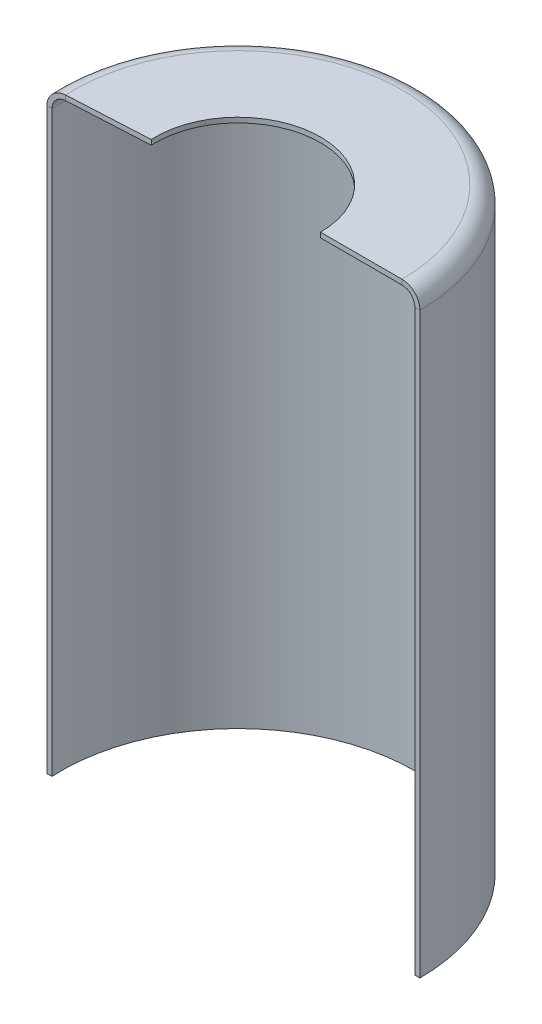
ISO-10303-21;
HEADER;
FILE_DESCRIPTION(('STEP AP214'),'2;1');
FILE_NAME('part.step','',(''),(''),'','','');
FILE_SCHEMA(('AUTOMOTIVE_DESIGN { 1 0 10303 214 1 1 1 1 }'));
ENDSEC;
DATA;
#1=APPLICATION_CONTEXT('core data for automotive mechanical design processes');
#2=APPLICATION_PROTOCOL_DEFINITION('international standard','automotive_design',2000,#1);
#3=PRODUCT_CONTEXT('',#1,'mechanical');
#4=PRODUCT('Part','Part','',(#3));
#5=PRODUCT_RELATED_PRODUCT_CATEGORY('part','',(#4));
#6=PRODUCT_DEFINITION_FORMATION('','',#4);
#7=PRODUCT_DEFINITION_CONTEXT('part definition',#1,'design');
#8=PRODUCT_DEFINITION('design','',#6,#7);
#9=PRODUCT_DEFINITION_SHAPE('','',#8);
#10=(LENGTH_UNIT() NAMED_UNIT(*) SI_UNIT(.MILLI.,.METRE.));
#11=(NAMED_UNIT(*) PLANE_ANGLE_UNIT() SI_UNIT($,.RADIAN.));
#12=(NAMED_UNIT(*) SI_UNIT($,.STERADIAN.) SOLID_ANGLE_UNIT());
#13=UNCERTAINTY_MEASURE_WITH_UNIT(LENGTH_MEASURE(1.E-05),#10,'distance_accuracy_value','');
#14=(GEOMETRIC_REPRESENTATION_CONTEXT(3) GLOBAL_UNCERTAINTY_ASSIGNED_CONTEXT((#13)) GLOBAL_UNIT_ASSIGNED_CONTEXT((#10,
#11,#12)) REPRESENTATION_CONTEXT('',''));
#15=CARTESIAN_POINT('',(0.,0.,0.));
#16=DIRECTION('',(0.,0.,1.));
#17=DIRECTION('',(1.,0.,0.));
#18=AXIS2_PLACEMENT_3D('',#15,#16,#17);
#19=CARTESIAN_POINT('',(-69.560421291519,116.4,1.73949960515557));
#20=DIRECTION('',(-0.0527070819916374,0.,-0.998610015725822));
#21=DIRECTION('',(-0.998610015725822,0.,0.0527070819916374));
#22=AXIS2_PLACEMENT_3D('',#19,#20,#21);
#23=PLANE('',#22);
#24=DIRECTION('',(0.,-1.,0.));
#25=VECTOR('',#24,1.);
#26=CARTESIAN_POINT('',(-69.560421291519,120.,1.73949960515556));
#27=LINE('',#26,#25);
#28=CARTESIAN_POINT('',(-69.560421291519,120.,1.73949960515556));
#29=VERTEX_POINT('',#28);
#30=CARTESIAN_POINT('',(-69.560421291519,119.,1.73949960515556));
#31=VERTEX_POINT('',#30);
#32=EDGE_CURVE('E11',#29,#31,#27,.T.);
#33=ORIENTED_EDGE('',*,*,#32,.F.);
#34=CARTESIAN_POINT('',(-69.560421291519,116.4,1.73949960515557));
#35=DIRECTION('',(0.0527070819916374,0.,0.998610015725822));
#36=DIRECTION('',(0.998610015725822,0.,-0.0527070819916374));
#37=AXIS2_PLACEMENT_3D('',#34,#35,#36);
#38=CIRCLE('',#37,3.6);
#39=CARTESIAN_POINT('',(-73.1554173481319,116.4,1.92924510032545));
#40=VERTEX_POINT('',#39);
#41=EDGE_CURVE('E134',#40,#29,#38,.F.);
#42=ORIENTED_EDGE('',*,*,#41,.F.);
#43=DIRECTION('',(0.998610015725822,0.,-0.052707081991637));
#44=VECTOR('',#43,1.);
#45=CARTESIAN_POINT('',(-73.1554173481319,116.4,1.92924510032545));
#46=LINE('',#45,#44);
#47=CARTESIAN_POINT('',(-72.1568073324061,116.4,1.87653801833379));
#48=VERTEX_POINT('',#47);
#49=EDGE_CURVE('E47',#40,#48,#46,.T.);
#50=ORIENTED_EDGE('',*,*,#49,.T.);
#51=CARTESIAN_POINT('',(-69.560421291519,116.4,1.73949960515557));
#52=DIRECTION('',(-0.0527070819916374,0.,-0.998610015725822));
#53=DIRECTION('',(-0.998610015725822,0.,0.0527070819916374));
#54=AXIS2_PLACEMENT_3D('',#51,#52,#53);
#55=CIRCLE('',#54,2.6);
#56=EDGE_CURVE('E131',#48,#31,#55,.T.);
#57=ORIENTED_EDGE('',*,*,#56,.T.);
#58=EDGE_LOOP('',(#33,#42,#50,#57));
#59=FACE_BOUND('',#58,.T.);
#60=ADVANCED_FACE('F37',(#59),#23,.F.);
#61=CARTESIAN_POINT('',(-73.1554173481319,58.2,1.92924510032547));
#62=DIRECTION('',(0.0527070819916374,0.,0.998610015725822));
#63=DIRECTION('',(0.,1.,0.));
#64=AXIS2_PLACEMENT_3D('',#61,#62,#63);
#65=PLANE('',#64);
#66=ORIENTED_EDGE('',*,*,#49,.F.);
#67=DIRECTION('',(0.,1.,0.));
#68=VECTOR('',#67,1.);
#69=CARTESIAN_POINT('',(-73.1554173481319,0.,1.92924510032547));
#70=LINE('',#69,#68);
#71=CARTESIAN_POINT('',(-73.1554173481319,0.,1.92924510032545));
#72=VERTEX_POINT('',#71);
#73=EDGE_CURVE('E174',#72,#40,#70,.T.);
#74=ORIENTED_EDGE('',*,*,#73,.F.);
#75=DIRECTION('',(0.998610015725822,0.,-0.052707081991637));
#76=VECTOR('',#75,1.);
#77=CARTESIAN_POINT('',(-73.1554173481319,0.,1.92924510032545));
#78=LINE('',#77,#76);
#79=CARTESIAN_POINT('',(-72.1568073324061,0.,1.87653801833379));
#80=VERTEX_POINT('',#79);
#81=EDGE_CURVE('E123',#72,#80,#78,.T.);
#82=ORIENTED_EDGE('',*,*,#81,.T.);
#83=DIRECTION('',(0.,1.,0.));
#84=VECTOR('',#83,1.);
#85=CARTESIAN_POINT('',(-72.1568073324061,0.,1.87653801833383));
#86=LINE('',#85,#84);
#87=EDGE_CURVE('E151',#80,#48,#86,.T.);
#88=ORIENTED_EDGE('',*,*,#87,.T.);
#89=EDGE_LOOP('',(#66,#74,#82,#88));
#90=FACE_BOUND('',#89,.T.);
#91=ADVANCED_FACE('F152',(#90),#65,.T.);
#92=CARTESIAN_POINT('',(-36.6031475738225,0.,0.));
#93=DIRECTION('',(0.,-1.,0.));
#94=DIRECTION('',(0.,0.,-1.));
#95=AXIS2_PLACEMENT_3D('',#92,#93,#94);
#96=PLANE('',#95);
#97=ORIENTED_EDGE('',*,*,#81,.F.);
#98=CARTESIAN_POINT('',(-36.6031475738225,0.,0.));
#99=DIRECTION('',(0.,1.,0.));
#100=DIRECTION('',(1.,0.,0.));
#101=AXIS2_PLACEMENT_3D('',#98,#99,#100);
#102=CIRCLE('',#101,36.6031475738225);
#103=CARTESIAN_POINT('',(0.,0.,0.));
#104=VERTEX_POINT('',#103);
#105=EDGE_CURVE('E101',#104,#72,#102,.T.);
#106=ORIENTED_EDGE('',*,*,#105,.F.);
#107=DIRECTION('',(-1.,0.,0.));
#108=VECTOR('',#107,1.);
#109=CARTESIAN_POINT('',(0.,0.,0.));
#110=LINE('',#109,#108);
#111=CARTESIAN_POINT('',(-1.,0.,0.));
#112=VERTEX_POINT('',#111);
#113=EDGE_CURVE('E120',#104,#112,#110,.T.);
#114=ORIENTED_EDGE('',*,*,#113,.T.);
#115=CARTESIAN_POINT('',(-36.6031475738225,0.,0.));
#116=DIRECTION('',(0.,1.,0.));
#117=DIRECTION('',(0.,0.,1.));
#118=AXIS2_PLACEMENT_3D('',#115,#116,#117);
#119=CIRCLE('',#118,35.6031475738225);
#120=EDGE_CURVE('E156',#112,#80,#119,.T.);
#121=ORIENTED_EDGE('',*,*,#120,.T.);
#122=EDGE_LOOP('',(#97,#106,#114,#121));
#123=FACE_BOUND('',#122,.T.);
#124=ADVANCED_FACE('F213',(#123),#96,.T.);
#125=CARTESIAN_POINT('',(0.,58.2,0.));
#126=DIRECTION('',(0.,0.,-1.));
#127=DIRECTION('',(0.,1.,0.));
#128=AXIS2_PLACEMENT_3D('',#125,#126,#127);
#129=PLANE('',#128);
#130=ORIENTED_EDGE('',*,*,#113,.F.);
#131=DIRECTION('',(0.,1.,0.));
#132=VECTOR('',#131,1.);
#133=CARTESIAN_POINT('',(0.,0.,0.));
#134=LINE('',#133,#132);
#135=CARTESIAN_POINT('',(0.,116.4,0.));
#136=VERTEX_POINT('',#135);
#137=EDGE_CURVE('E171',#104,#136,#134,.T.);
#138=ORIENTED_EDGE('',*,*,#137,.T.);
#139=DIRECTION('',(-1.,0.,0.));
#140=VECTOR('',#139,1.);
#141=CARTESIAN_POINT('',(0.,116.4,0.));
#142=LINE('',#141,#140);
#143=CARTESIAN_POINT('',(-1.,116.4,0.));
#144=VERTEX_POINT('',#143);
#145=EDGE_CURVE('E117',#136,#144,#142,.T.);
#146=ORIENTED_EDGE('',*,*,#145,.T.);
#147=DIRECTION('',(0.,1.,0.));
#148=VECTOR('',#147,1.);
#149=CARTESIAN_POINT('',(-1.,0.,0.));
#150=LINE('',#149,#148);
#151=EDGE_CURVE('E108',#112,#144,#150,.T.);
#152=ORIENTED_EDGE('',*,*,#151,.F.);
#153=EDGE_LOOP('',(#130,#138,#146,#152));
#154=FACE_BOUND('',#153,.T.);
#155=ADVANCED_FACE('F218',(#154),#129,.F.);
#156=CARTESIAN_POINT('',(-3.6,116.4,0.));
#157=DIRECTION('',(0.,0.,1.));
#158=DIRECTION('',(1.,0.,0.));
#159=AXIS2_PLACEMENT_3D('',#156,#157,#158);
#160=PLANE('',#159);
#161=ORIENTED_EDGE('',*,*,#145,.F.);
#162=CARTESIAN_POINT('',(-3.6,116.4,0.));
#163=DIRECTION('',(0.,0.,-1.));
#164=DIRECTION('',(-1.,0.,0.));
#165=AXIS2_PLACEMENT_3D('',#162,#163,#164);
#166=CIRCLE('',#165,3.6);
#167=CARTESIAN_POINT('',(-3.6,120.,0.));
#168=VERTEX_POINT('',#167);
#169=EDGE_CURVE('E102',#136,#168,#166,.F.);
#170=ORIENTED_EDGE('',*,*,#169,.T.);
#171=DIRECTION('',(0.,-1.,0.));
#172=VECTOR('',#171,1.);
#173=CARTESIAN_POINT('',(-3.6,120.,0.));
#174=LINE('',#173,#172);
#175=CARTESIAN_POINT('',(-3.6,119.,0.));
#176=VERTEX_POINT('',#175);
#177=EDGE_CURVE('E91',#168,#176,#174,.T.);
#178=ORIENTED_EDGE('',*,*,#177,.T.);
#179=CARTESIAN_POINT('',(-3.6,116.4,0.));
#180=DIRECTION('',(0.,0.,1.));
#181=DIRECTION('',(1.,0.,0.));
#182=AXIS2_PLACEMENT_3D('',#179,#180,#181);
#183=CIRCLE('',#182,2.6);
#184=EDGE_CURVE('E111',#144,#176,#183,.T.);
#185=ORIENTED_EDGE('',*,*,#184,.F.);
#186=EDGE_LOOP('',(#161,#170,#178,#185));
#187=FACE_BOUND('',#186,.T.);
#188=ADVANCED_FACE('F199',(#187),#160,.T.);
#189=CARTESIAN_POINT('',(0.,120.,0.));
#190=DIRECTION('',(0.,0.,1.));
#191=DIRECTION('',(-1.,0.,0.));
#192=AXIS2_PLACEMENT_3D('',#189,#190,#191);
#193=PLANE('',#192);
#194=ORIENTED_EDGE('',*,*,#177,.F.);
#195=DIRECTION('',(-1.,0.,0.));
#196=VECTOR('',#195,1.);
#197=CARTESIAN_POINT('',(0.,120.,0.));
#198=LINE('',#197,#196);
#199=CARTESIAN_POINT('',(-20.,120.,0.));
#200=VERTEX_POINT('',#199);
#201=EDGE_CURVE('E94',#168,#200,#198,.T.);
#202=ORIENTED_EDGE('',*,*,#201,.T.);
#203=DIRECTION('',(0.,-1.,0.));
#204=VECTOR('',#203,1.);
#205=CARTESIAN_POINT('',(-20.,120.,0.));
#206=LINE('',#205,#204);
#207=CARTESIAN_POINT('',(-20.,119.,0.));
#208=VERTEX_POINT('',#207);
#209=EDGE_CURVE('E80',#200,#208,#206,.T.);
#210=ORIENTED_EDGE('',*,*,#209,.T.);
#211=DIRECTION('',(1.,0.,0.));
#212=VECTOR('',#211,1.);
#213=CARTESIAN_POINT('',(0.,119.,0.));
#214=LINE('',#213,#212);
#215=EDGE_CURVE('E166',#176,#208,#214,.F.);
#216=ORIENTED_EDGE('',*,*,#215,.F.);
#217=EDGE_LOOP('',(#194,#202,#210,#216));
#218=FACE_BOUND('',#217,.T.);
#219=ADVANCED_FACE('F95',(#218),#193,.T.);
#220=CARTESIAN_POINT('',(-36.6031475738225,120.,0.));
#221=DIRECTION('',(0.,1.,0.));
#222=DIRECTION('',(0.,0.,1.));
#223=AXIS2_PLACEMENT_3D('',#220,#221,#222);
#224=CYLINDRICAL_SURFACE('',#223,16.6031475738225);
#225=ORIENTED_EDGE('',*,*,#209,.F.);
#226=CARTESIAN_POINT('',(-36.6031475738225,120.,0.));
#227=DIRECTION('',(0.,1.,0.));
#228=DIRECTION('',(1.,0.,0.));
#229=AXIS2_PLACEMENT_3D('',#226,#227,#228);
#230=CIRCLE('',#229,16.6031475738225);
#231=CARTESIAN_POINT('',(-53.1832170336155,120.,0.87510346049271));
#232=VERTEX_POINT('',#231);
#233=EDGE_CURVE('E84',#200,#232,#230,.T.);
#234=ORIENTED_EDGE('',*,*,#233,.T.);
#235=DIRECTION('',(0.,-1.,0.));
#236=VECTOR('',#235,1.);
#237=CARTESIAN_POINT('',(-53.1832170336155,120.,0.87510346049271));
#238=LINE('',#237,#236);
#239=CARTESIAN_POINT('',(-53.1832170336155,119.,0.87510346049271));
#240=VERTEX_POINT('',#239);
#241=EDGE_CURVE('E41',#232,#240,#238,.T.);
#242=ORIENTED_EDGE('',*,*,#241,.T.);
#243=CARTESIAN_POINT('',(-36.6031475738225,119.,0.));
#244=DIRECTION('',(0.,1.,0.));
#245=DIRECTION('',(0.,0.,1.));
#246=AXIS2_PLACEMENT_3D('',#243,#244,#245);
#247=CIRCLE('',#246,16.6031475738225);
#248=EDGE_CURVE('E87',#208,#240,#247,.T.);
#249=ORIENTED_EDGE('',*,*,#248,.F.);
#250=EDGE_LOOP('',(#225,#234,#242,#249));
#251=FACE_BOUND('',#250,.T.);
#252=ADVANCED_FACE('F82',(#251),#224,.F.);
#253=CARTESIAN_POINT('',(-73.1554173481319,120.,1.92924510032547));
#254=DIRECTION('',(-0.0527070819916374,0.,-0.998610015725822));
#255=DIRECTION('',(0.998610015725822,0.,-0.0527070819916374));
#256=AXIS2_PLACEMENT_3D('',#253,#254,#255);
#257=PLANE('',#256);
#258=DIRECTION('',(0.998610015725822,0.,-0.0527070819916374));
#259=VECTOR('',#258,1.);
#260=CARTESIAN_POINT('',(-73.1554173481319,120.,1.92924510032547));
#261=LINE('',#260,#259);
#262=EDGE_CURVE('E107',#29,#232,#261,.T.);
#263=ORIENTED_EDGE('',*,*,#262,.F.);
#264=ORIENTED_EDGE('',*,*,#32,.T.);
#265=DIRECTION('',(0.998610015725822,0.,-0.0527070819916374));
#266=VECTOR('',#265,1.);
#267=CARTESIAN_POINT('',(-73.1554173481319,119.,1.92924510032547));
#268=LINE('',#267,#266);
#269=EDGE_CURVE('E165',#31,#240,#268,.T.);
#270=ORIENTED_EDGE('',*,*,#269,.T.);
#271=ORIENTED_EDGE('',*,*,#241,.F.);
#272=EDGE_LOOP('',(#263,#264,#270,#271));
#273=FACE_BOUND('',#272,.T.);
#274=ADVANCED_FACE('F39',(#273),#257,.F.);
#275=CARTESIAN_POINT('',(0.,119.,0.));
#276=DIRECTION('',(0.,-1.,0.));
#277=DIRECTION('',(0.,0.,-1.));
#278=AXIS2_PLACEMENT_3D('',#275,#276,#277);
#279=PLANE('',#278);
#280=ORIENTED_EDGE('',*,*,#248,.T.);
#281=ORIENTED_EDGE('',*,*,#269,.F.);
#282=CARTESIAN_POINT('',(-36.6031475738225,119.,0.));
#283=DIRECTION('',(0.,1.,0.));
#284=DIRECTION('',(0.,0.,1.));
#285=AXIS2_PLACEMENT_3D('',#282,#283,#284);
#286=CIRCLE('',#285,33.0031475738225);
#287=EDGE_CURVE('E148',#176,#31,#286,.T.);
#288=ORIENTED_EDGE('',*,*,#287,.F.);
#289=ORIENTED_EDGE('',*,*,#215,.T.);
#290=EDGE_LOOP('',(#280,#281,#288,#289));
#291=FACE_BOUND('',#290,.T.);
#292=ADVANCED_FACE('F201',(#291),#279,.T.);
#293=CARTESIAN_POINT('',(-36.6031475738225,116.4,0.));
#294=DIRECTION('',(0.,1.,0.));
#295=DIRECTION('',(0.,0.,1.));
#296=AXIS2_PLACEMENT_3D('',#293,#294,#295);
#297=TOROIDAL_SURFACE('',#296,33.0031475738225,2.6);
#298=ORIENTED_EDGE('',*,*,#287,.T.);
#299=ORIENTED_EDGE('',*,*,#56,.F.);
#300=CARTESIAN_POINT('',(-36.6031475738225,116.4,0.));
#301=DIRECTION('',(0.,1.,0.));
#302=DIRECTION('',(0.,0.,1.));
#303=AXIS2_PLACEMENT_3D('',#300,#301,#302);
#304=CIRCLE('',#303,35.6031475738225);
#305=EDGE_CURVE('E146',#144,#48,#304,.T.);
#306=ORIENTED_EDGE('',*,*,#305,.F.);
#307=ORIENTED_EDGE('',*,*,#184,.T.);
#308=EDGE_LOOP('',(#298,#299,#306,#307));
#309=FACE_BOUND('',#308,.T.);
#310=ADVANCED_FACE('F142',(#309),#297,.F.);
#311=CARTESIAN_POINT('',(-36.6031475738225,0.,0.));
#312=DIRECTION('',(0.,1.,0.));
#313=DIRECTION('',(0.,0.,1.));
#314=AXIS2_PLACEMENT_3D('',#311,#312,#313);
#315=CYLINDRICAL_SURFACE('',#314,35.6031475738225);
#316=ORIENTED_EDGE('',*,*,#305,.T.);
#317=ORIENTED_EDGE('',*,*,#87,.F.);
#318=ORIENTED_EDGE('',*,*,#120,.F.);
#319=ORIENTED_EDGE('',*,*,#151,.T.);
#320=EDGE_LOOP('',(#316,#317,#318,#319));
#321=FACE_BOUND('',#320,.T.);
#322=ADVANCED_FACE('F158',(#321),#315,.F.);
#323=CARTESIAN_POINT('',(0.,120.,0.));
#324=DIRECTION('',(0.,-1.,0.));
#325=DIRECTION('',(0.,0.,-1.));
#326=AXIS2_PLACEMENT_3D('',#323,#324,#325);
#327=PLANE('',#326);
#328=ORIENTED_EDGE('',*,*,#233,.F.);
#329=ORIENTED_EDGE('',*,*,#201,.F.);
#330=CARTESIAN_POINT('',(-36.6031475738225,120.,0.));
#331=DIRECTION('',(0.,1.,0.));
#332=DIRECTION('',(1.,0.,0.));
#333=AXIS2_PLACEMENT_3D('',#330,#331,#332);
#334=CIRCLE('',#333,33.0031475738225);
#335=EDGE_CURVE('E113',#168,#29,#334,.T.);
#336=ORIENTED_EDGE('',*,*,#335,.T.);
#337=ORIENTED_EDGE('',*,*,#262,.T.);
#338=EDGE_LOOP('',(#328,#329,#336,#337));
#339=FACE_BOUND('',#338,.T.);
#340=ADVANCED_FACE('F105',(#339),#327,.F.);
#341=CARTESIAN_POINT('',(-36.6031475738225,116.4,0.));
#342=DIRECTION('',(0.,1.,0.));
#343=DIRECTION('',(0.,0.,1.));
#344=AXIS2_PLACEMENT_3D('',#341,#342,#343);
#345=TOROIDAL_SURFACE('',#344,33.0031475738225,3.6);
#346=ORIENTED_EDGE('',*,*,#335,.F.);
#347=ORIENTED_EDGE('',*,*,#169,.F.);
#348=CARTESIAN_POINT('',(-36.6031475738225,116.4,0.));
#349=DIRECTION('',(0.,1.,0.));
#350=DIRECTION('',(1.,0.,0.));
#351=AXIS2_PLACEMENT_3D('',#348,#349,#350);
#352=CIRCLE('',#351,36.6031475738225);
#353=EDGE_CURVE('E177',#136,#40,#352,.T.);
#354=ORIENTED_EDGE('',*,*,#353,.T.);
#355=ORIENTED_EDGE('',*,*,#41,.T.);
#356=EDGE_LOOP('',(#346,#347,#354,#355));
#357=FACE_BOUND('',#356,.T.);
#358=ADVANCED_FACE('F185',(#357),#345,.T.);
#359=CARTESIAN_POINT('',(-36.6031475738225,0.,0.));
#360=DIRECTION('',(0.,1.,0.));
#361=DIRECTION('',(0.,0.,1.));
#362=AXIS2_PLACEMENT_3D('',#359,#360,#361);
#363=CYLINDRICAL_SURFACE('',#362,36.6031475738225);
#364=ORIENTED_EDGE('',*,*,#353,.F.);
#365=ORIENTED_EDGE('',*,*,#137,.F.);
#366=ORIENTED_EDGE('',*,*,#105,.T.);
#367=ORIENTED_EDGE('',*,*,#73,.T.);
#368=EDGE_LOOP('',(#364,#365,#366,#367));
#369=FACE_BOUND('',#368,.T.);
#370=ADVANCED_FACE('F232',(#369),#363,.T.);
#371=CLOSED_SHELL('',(#60,#91,#124,#155,#188,#219,#252,#274,#292,#310,#322,#340,#358,#370));
#372=MANIFOLD_SOLID_BREP('B2',#371);
#373=ADVANCED_BREP_SHAPE_REPRESENTATION('',(#18,#372),#14);
#374=SHAPE_DEFINITION_REPRESENTATION(#9,#373);
ENDSEC;
END-ISO-10303-21;
